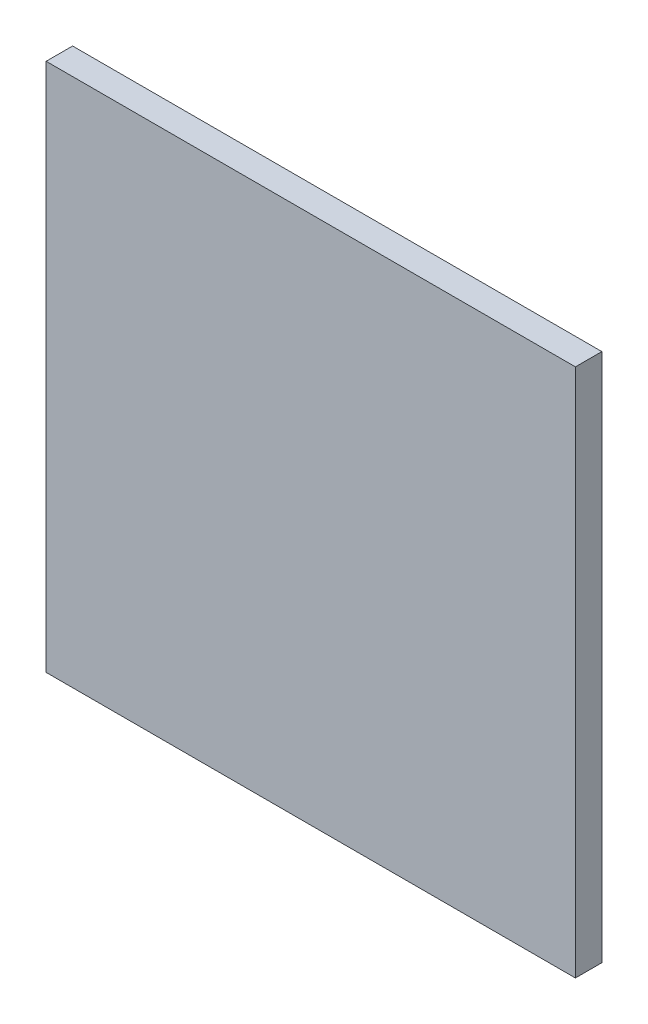
ISO-10303-21;
HEADER;
FILE_DESCRIPTION(('STEP AP214'),'2;1');
FILE_NAME('part.step','',(''),(''),'','','');
FILE_SCHEMA(('AUTOMOTIVE_DESIGN { 1 0 10303 214 1 1 1 1 }'));
ENDSEC;
DATA;
#1=APPLICATION_CONTEXT('core data for automotive mechanical design processes');
#2=APPLICATION_PROTOCOL_DEFINITION('international standard','automotive_design',2000,#1);
#3=PRODUCT_CONTEXT('',#1,'mechanical');
#4=PRODUCT('Part','Part','',(#3));
#5=PRODUCT_RELATED_PRODUCT_CATEGORY('part','',(#4));
#6=PRODUCT_DEFINITION_FORMATION('','',#4);
#7=PRODUCT_DEFINITION_CONTEXT('part definition',#1,'design');
#8=PRODUCT_DEFINITION('design','',#6,#7);
#9=PRODUCT_DEFINITION_SHAPE('','',#8);
#10=(LENGTH_UNIT() NAMED_UNIT(*) SI_UNIT(.MILLI.,.METRE.));
#11=(NAMED_UNIT(*) PLANE_ANGLE_UNIT() SI_UNIT($,.RADIAN.));
#12=(NAMED_UNIT(*) SI_UNIT($,.STERADIAN.) SOLID_ANGLE_UNIT());
#13=UNCERTAINTY_MEASURE_WITH_UNIT(LENGTH_MEASURE(1.E-05),#10,'distance_accuracy_value','');
#14=(GEOMETRIC_REPRESENTATION_CONTEXT(3) GLOBAL_UNCERTAINTY_ASSIGNED_CONTEXT((#13)) GLOBAL_UNIT_ASSIGNED_CONTEXT((#10,
#11,#12)) REPRESENTATION_CONTEXT('',''));
#15=CARTESIAN_POINT('',(0.,0.,0.));
#16=DIRECTION('',(0.,0.,1.));
#17=DIRECTION('',(1.,0.,0.));
#18=AXIS2_PLACEMENT_3D('',#15,#16,#17);
#19=CARTESIAN_POINT('',(2500.,2500.,250.));
#20=DIRECTION('',(-1.,0.,0.));
#21=DIRECTION('',(0.,-1.,0.));
#22=AXIS2_PLACEMENT_3D('',#19,#20,#21);
#23=PLANE('',#22);
#24=DIRECTION('',(0.,1.,0.));
#25=VECTOR('',#24,1.);
#26=CARTESIAN_POINT('',(2500.,2500.,0.));
#27=LINE('',#26,#25);
#28=CARTESIAN_POINT('',(2500.,-2500.,0.));
#29=VERTEX_POINT('',#28);
#30=CARTESIAN_POINT('',(2500.,2500.,0.));
#31=VERTEX_POINT('',#30);
#32=EDGE_CURVE('E96',#29,#31,#27,.T.);
#33=ORIENTED_EDGE('',*,*,#32,.T.);
#34=DIRECTION('',(0.,0.,-1.));
#35=VECTOR('',#34,1.);
#36=CARTESIAN_POINT('',(2500.,2500.,250.));
#37=LINE('',#36,#35);
#38=CARTESIAN_POINT('',(2500.,2500.,250.));
#39=VERTEX_POINT('',#38);
#40=EDGE_CURVE('E11',#39,#31,#37,.T.);
#41=ORIENTED_EDGE('',*,*,#40,.F.);
#42=DIRECTION('',(0.,1.,0.));
#43=VECTOR('',#42,1.);
#44=CARTESIAN_POINT('',(2500.,2500.,250.));
#45=LINE('',#44,#43);
#46=CARTESIAN_POINT('',(2500.,-2500.,250.));
#47=VERTEX_POINT('',#46);
#48=EDGE_CURVE('E84',#47,#39,#45,.T.);
#49=ORIENTED_EDGE('',*,*,#48,.F.);
#50=DIRECTION('',(0.,0.,-1.));
#51=VECTOR('',#50,1.);
#52=CARTESIAN_POINT('',(2500.,-2500.,250.));
#53=LINE('',#52,#51);
#54=EDGE_CURVE('E92',#47,#29,#53,.T.);
#55=ORIENTED_EDGE('',*,*,#54,.T.);
#56=EDGE_LOOP('',(#33,#41,#49,#55));
#57=FACE_BOUND('',#56,.T.);
#58=ADVANCED_FACE('F33',(#57),#23,.F.);
#59=CARTESIAN_POINT('',(-2500.,2500.,250.));
#60=DIRECTION('',(0.,-1.,0.));
#61=DIRECTION('',(0.,0.,-1.));
#62=AXIS2_PLACEMENT_3D('',#59,#60,#61);
#63=PLANE('',#62);
#64=DIRECTION('',(-1.,0.,0.));
#65=VECTOR('',#64,1.);
#66=CARTESIAN_POINT('',(-2500.,2500.,0.));
#67=LINE('',#66,#65);
#68=CARTESIAN_POINT('',(-2500.,2500.,0.));
#69=VERTEX_POINT('',#68);
#70=EDGE_CURVE('E88',#31,#69,#67,.T.);
#71=ORIENTED_EDGE('',*,*,#70,.T.);
#72=DIRECTION('',(0.,0.,-1.));
#73=VECTOR('',#72,1.);
#74=CARTESIAN_POINT('',(-2500.,2500.,250.));
#75=LINE('',#74,#73);
#76=CARTESIAN_POINT('',(-2500.,2500.,250.));
#77=VERTEX_POINT('',#76);
#78=EDGE_CURVE('E41',#77,#69,#75,.T.);
#79=ORIENTED_EDGE('',*,*,#78,.F.);
#80=DIRECTION('',(-1.,0.,0.));
#81=VECTOR('',#80,1.);
#82=CARTESIAN_POINT('',(-2500.,2500.,250.));
#83=LINE('',#82,#81);
#84=EDGE_CURVE('E79',#39,#77,#83,.T.);
#85=ORIENTED_EDGE('',*,*,#84,.F.);
#86=ORIENTED_EDGE('',*,*,#40,.T.);
#87=EDGE_LOOP('',(#71,#79,#85,#86));
#88=FACE_BOUND('',#87,.T.);
#89=ADVANCED_FACE('F87',(#88),#63,.F.);
#90=CARTESIAN_POINT('',(-2500.,2500.,250.));
#91=DIRECTION('',(1.,0.,0.));
#92=DIRECTION('',(0.,1.,0.));
#93=AXIS2_PLACEMENT_3D('',#90,#91,#92);
#94=PLANE('',#93);
#95=DIRECTION('',(0.,-1.,0.));
#96=VECTOR('',#95,1.);
#97=CARTESIAN_POINT('',(-2500.,2500.,0.));
#98=LINE('',#97,#96);
#99=CARTESIAN_POINT('',(-2500.,-2500.,0.));
#100=VERTEX_POINT('',#99);
#101=EDGE_CURVE('E66',#69,#100,#98,.T.);
#102=ORIENTED_EDGE('',*,*,#101,.T.);
#103=DIRECTION('',(0.,0.,-1.));
#104=VECTOR('',#103,1.);
#105=CARTESIAN_POINT('',(-2500.,-2500.,250.));
#106=LINE('',#105,#104);
#107=CARTESIAN_POINT('',(-2500.,-2500.,250.));
#108=VERTEX_POINT('',#107);
#109=EDGE_CURVE('E89',#108,#100,#106,.T.);
#110=ORIENTED_EDGE('',*,*,#109,.F.);
#111=DIRECTION('',(0.,-1.,0.));
#112=VECTOR('',#111,1.);
#113=CARTESIAN_POINT('',(-2500.,2500.,250.));
#114=LINE('',#113,#112);
#115=EDGE_CURVE('E82',#77,#108,#114,.T.);
#116=ORIENTED_EDGE('',*,*,#115,.F.);
#117=ORIENTED_EDGE('',*,*,#78,.T.);
#118=EDGE_LOOP('',(#102,#110,#116,#117));
#119=FACE_BOUND('',#118,.T.);
#120=ADVANCED_FACE('F90',(#119),#94,.F.);
#121=CARTESIAN_POINT('',(-2500.,-2500.,250.));
#122=DIRECTION('',(0.,1.,0.));
#123=DIRECTION('',(0.,0.,1.));
#124=AXIS2_PLACEMENT_3D('',#121,#122,#123);
#125=PLANE('',#124);
#126=DIRECTION('',(1.,0.,0.));
#127=VECTOR('',#126,1.);
#128=CARTESIAN_POINT('',(-2500.,-2500.,0.));
#129=LINE('',#128,#127);
#130=EDGE_CURVE('E72',#100,#29,#129,.T.);
#131=ORIENTED_EDGE('',*,*,#130,.T.);
#132=ORIENTED_EDGE('',*,*,#54,.F.);
#133=DIRECTION('',(1.,0.,0.));
#134=VECTOR('',#133,1.);
#135=CARTESIAN_POINT('',(-2500.,-2500.,250.));
#136=LINE('',#135,#134);
#137=EDGE_CURVE('E49',#108,#47,#136,.T.);
#138=ORIENTED_EDGE('',*,*,#137,.F.);
#139=ORIENTED_EDGE('',*,*,#109,.T.);
#140=EDGE_LOOP('',(#131,#132,#138,#139));
#141=FACE_BOUND('',#140,.T.);
#142=ADVANCED_FACE('F103',(#141),#125,.F.);
#143=CARTESIAN_POINT('',(0.,0.,250.));
#144=DIRECTION('',(0.,0.,1.));
#145=DIRECTION('',(1.,0.,0.));
#146=AXIS2_PLACEMENT_3D('',#143,#144,#145);
#147=PLANE('',#146);
#148=ORIENTED_EDGE('',*,*,#48,.T.);
#149=ORIENTED_EDGE('',*,*,#84,.T.);
#150=ORIENTED_EDGE('',*,*,#115,.T.);
#151=ORIENTED_EDGE('',*,*,#137,.T.);
#152=EDGE_LOOP('',(#148,#149,#150,#151));
#153=FACE_BOUND('',#152,.T.);
#154=ADVANCED_FACE('F80',(#153),#147,.T.);
#155=CARTESIAN_POINT('',(0.,0.,0.));
#156=DIRECTION('',(0.,0.,1.));
#157=DIRECTION('',(1.,0.,0.));
#158=AXIS2_PLACEMENT_3D('',#155,#156,#157);
#159=PLANE('',#158);
#160=ORIENTED_EDGE('',*,*,#32,.F.);
#161=ORIENTED_EDGE('',*,*,#130,.F.);
#162=ORIENTED_EDGE('',*,*,#101,.F.);
#163=ORIENTED_EDGE('',*,*,#70,.F.);
#164=EDGE_LOOP('',(#160,#161,#162,#163));
#165=FACE_BOUND('',#164,.T.);
#166=ADVANCED_FACE('F106',(#165),#159,.F.);
#167=CLOSED_SHELL('',(#58,#89,#120,#142,#154,#166));
#168=MANIFOLD_SOLID_BREP('B2',#167);
#169=ADVANCED_BREP_SHAPE_REPRESENTATION('',(#18,#168),#14);
#170=SHAPE_DEFINITION_REPRESENTATION(#9,#169);
ENDSEC;
END-ISO-10303-21;
